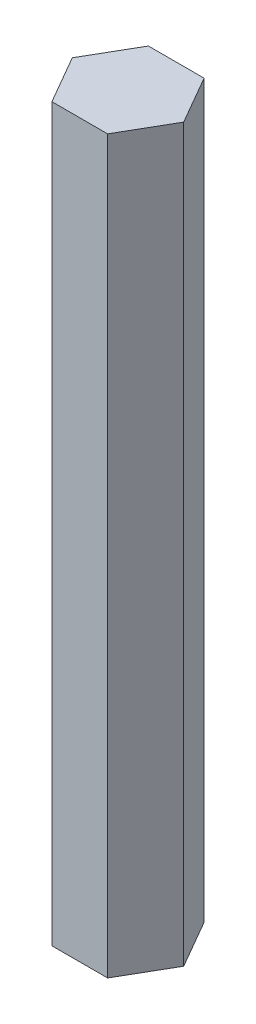
ISO-10303-21;
HEADER;
FILE_DESCRIPTION(('STEP AP214'),'2;1');
FILE_NAME('part.step','',(''),(''),'','','');
FILE_SCHEMA(('AUTOMOTIVE_DESIGN { 1 0 10303 214 1 1 1 1 }'));
ENDSEC;
DATA;
#1=APPLICATION_CONTEXT('core data for automotive mechanical design processes');
#2=APPLICATION_PROTOCOL_DEFINITION('international standard','automotive_design',2000,#1);
#3=PRODUCT_CONTEXT('',#1,'mechanical');
#4=PRODUCT('Part','Part','',(#3));
#5=PRODUCT_RELATED_PRODUCT_CATEGORY('part','',(#4));
#6=PRODUCT_DEFINITION_FORMATION('','',#4);
#7=PRODUCT_DEFINITION_CONTEXT('part definition',#1,'design');
#8=PRODUCT_DEFINITION('design','',#6,#7);
#9=PRODUCT_DEFINITION_SHAPE('','',#8);
#10=(LENGTH_UNIT() NAMED_UNIT(*) SI_UNIT(.MILLI.,.METRE.));
#11=(NAMED_UNIT(*) PLANE_ANGLE_UNIT() SI_UNIT($,.RADIAN.));
#12=(NAMED_UNIT(*) SI_UNIT($,.STERADIAN.) SOLID_ANGLE_UNIT());
#13=UNCERTAINTY_MEASURE_WITH_UNIT(LENGTH_MEASURE(1.E-05),#10,'distance_accuracy_value','');
#14=(GEOMETRIC_REPRESENTATION_CONTEXT(3) GLOBAL_UNCERTAINTY_ASSIGNED_CONTEXT((#13)) GLOBAL_UNIT_ASSIGNED_CONTEXT((#10,
#11,#12)) REPRESENTATION_CONTEXT('',''));
#15=CARTESIAN_POINT('',(0.,0.,0.));
#16=DIRECTION('',(0.,0.,1.));
#17=DIRECTION('',(1.,0.,0.));
#18=AXIS2_PLACEMENT_3D('',#15,#16,#17);
#19=CARTESIAN_POINT('',(3.97705905170191,105.,5.34885921686965));
#20=DIRECTION('',(-0.866025403784439,0.,-0.5));
#21=DIRECTION('',(-0.5,0.,0.866025403784439));
#22=AXIS2_PLACEMENT_3D('',#19,#20,#21);
#23=PLANE('',#22);
#24=DIRECTION('',(0.5,0.,-0.866025403784439));
#25=VECTOR('',#24,1.);
#26=CARTESIAN_POINT('',(3.97705905170191,0.,5.34885921686965));
#27=LINE('',#26,#25);
#28=CARTESIAN_POINT('',(3.97705905170191,0.,5.34885921686965));
#29=VERTEX_POINT('',#28);
#30=CARTESIAN_POINT('',(7.97705905170191,0.,-1.57934401340586));
#31=VERTEX_POINT('',#30);
#32=EDGE_CURVE('E123',#29,#31,#27,.T.);
#33=ORIENTED_EDGE('',*,*,#32,.T.);
#34=DIRECTION('',(0.,-1.,0.));
#35=VECTOR('',#34,1.);
#36=CARTESIAN_POINT('',(7.97705905170191,105.,-1.57934401340586));
#37=LINE('',#36,#35);
#38=CARTESIAN_POINT('',(7.97705905170191,105.,-1.57934401340586));
#39=VERTEX_POINT('',#38);
#40=EDGE_CURVE('E11',#39,#31,#37,.T.);
#41=ORIENTED_EDGE('',*,*,#40,.F.);
#42=DIRECTION('',(0.5,0.,-0.866025403784439));
#43=VECTOR('',#42,1.);
#44=CARTESIAN_POINT('',(3.97705905170191,105.,5.34885921686965));
#45=LINE('',#44,#43);
#46=CARTESIAN_POINT('',(3.97705905170191,105.,5.34885921686965));
#47=VERTEX_POINT('',#46);
#48=EDGE_CURVE('E133',#47,#39,#45,.T.);
#49=ORIENTED_EDGE('',*,*,#48,.F.);
#50=DIRECTION('',(0.,-1.,0.));
#51=VECTOR('',#50,1.);
#52=CARTESIAN_POINT('',(3.97705905170191,105.,5.34885921686965));
#53=LINE('',#52,#51);
#54=EDGE_CURVE('E119',#47,#29,#53,.T.);
#55=ORIENTED_EDGE('',*,*,#54,.T.);
#56=EDGE_LOOP('',(#33,#41,#49,#55));
#57=FACE_BOUND('',#56,.T.);
#58=ADVANCED_FACE('F39',(#57),#23,.F.);
#59=CARTESIAN_POINT('',(7.97705905170191,105.,-1.57934401340586));
#60=DIRECTION('',(-0.866025403784439,0.,0.5));
#61=DIRECTION('',(0.5,0.,0.866025403784439));
#62=AXIS2_PLACEMENT_3D('',#59,#60,#61);
#63=PLANE('',#62);
#64=DIRECTION('',(-0.5,0.,-0.866025403784439));
#65=VECTOR('',#64,1.);
#66=CARTESIAN_POINT('',(7.97705905170191,0.,-1.57934401340586));
#67=LINE('',#66,#65);
#68=CARTESIAN_POINT('',(3.97705905170191,0.,-8.50754724368137));
#69=VERTEX_POINT('',#68);
#70=EDGE_CURVE('E126',#31,#69,#67,.T.);
#71=ORIENTED_EDGE('',*,*,#70,.T.);
#72=DIRECTION('',(0.,-1.,0.));
#73=VECTOR('',#72,1.);
#74=CARTESIAN_POINT('',(3.97705905170191,105.,-8.50754724368137));
#75=LINE('',#74,#73);
#76=CARTESIAN_POINT('',(3.97705905170191,105.,-8.50754724368137));
#77=VERTEX_POINT('',#76);
#78=EDGE_CURVE('E47',#77,#69,#75,.T.);
#79=ORIENTED_EDGE('',*,*,#78,.F.);
#80=DIRECTION('',(-0.5,0.,-0.866025403784439));
#81=VECTOR('',#80,1.);
#82=CARTESIAN_POINT('',(7.97705905170191,105.,-1.57934401340586));
#83=LINE('',#82,#81);
#84=EDGE_CURVE('E92',#39,#77,#83,.T.);
#85=ORIENTED_EDGE('',*,*,#84,.F.);
#86=ORIENTED_EDGE('',*,*,#40,.T.);
#87=EDGE_LOOP('',(#71,#79,#85,#86));
#88=FACE_BOUND('',#87,.T.);
#89=ADVANCED_FACE('F157',(#88),#63,.F.);
#90=CARTESIAN_POINT('',(3.97705905170191,105.,-8.50754724368137));
#91=DIRECTION('',(0.,0.,1.));
#92=DIRECTION('',(1.,0.,0.));
#93=AXIS2_PLACEMENT_3D('',#90,#91,#92);
#94=PLANE('',#93);
#95=DIRECTION('',(-1.,0.,0.));
#96=VECTOR('',#95,1.);
#97=CARTESIAN_POINT('',(3.97705905170191,0.,-8.50754724368137));
#98=LINE('',#97,#96);
#99=CARTESIAN_POINT('',(-4.02294094829809,0.,-8.50754724368137));
#100=VERTEX_POINT('',#99);
#101=EDGE_CURVE('E128',#69,#100,#98,.T.);
#102=ORIENTED_EDGE('',*,*,#101,.T.);
#103=DIRECTION('',(0.,-1.,0.));
#104=VECTOR('',#103,1.);
#105=CARTESIAN_POINT('',(-4.02294094829809,105.,-8.50754724368137));
#106=LINE('',#105,#104);
#107=CARTESIAN_POINT('',(-4.02294094829809,105.,-8.50754724368137));
#108=VERTEX_POINT('',#107);
#109=EDGE_CURVE('E114',#108,#100,#106,.T.);
#110=ORIENTED_EDGE('',*,*,#109,.F.);
#111=DIRECTION('',(-1.,0.,0.));
#112=VECTOR('',#111,1.);
#113=CARTESIAN_POINT('',(3.97705905170191,105.,-8.50754724368137));
#114=LINE('',#113,#112);
#115=EDGE_CURVE('E105',#77,#108,#114,.T.);
#116=ORIENTED_EDGE('',*,*,#115,.F.);
#117=ORIENTED_EDGE('',*,*,#78,.T.);
#118=EDGE_LOOP('',(#102,#110,#116,#117));
#119=FACE_BOUND('',#118,.T.);
#120=ADVANCED_FACE('F139',(#119),#94,.F.);
#121=CARTESIAN_POINT('',(-4.02294094829809,105.,-8.50754724368137));
#122=DIRECTION('',(0.866025403784439,0.,0.5));
#123=DIRECTION('',(0.5,0.,-0.866025403784439));
#124=AXIS2_PLACEMENT_3D('',#121,#122,#123);
#125=PLANE('',#124);
#126=DIRECTION('',(-0.5,0.,0.866025403784439));
#127=VECTOR('',#126,1.);
#128=CARTESIAN_POINT('',(-4.02294094829809,0.,-8.50754724368137));
#129=LINE('',#128,#127);
#130=CARTESIAN_POINT('',(-8.02294094829809,0.,-1.57934401340586));
#131=VERTEX_POINT('',#130);
#132=EDGE_CURVE('E113',#100,#131,#129,.T.);
#133=ORIENTED_EDGE('',*,*,#132,.T.);
#134=DIRECTION('',(0.,-1.,0.));
#135=VECTOR('',#134,1.);
#136=CARTESIAN_POINT('',(-8.02294094829809,105.,-1.57934401340586));
#137=LINE('',#136,#135);
#138=CARTESIAN_POINT('',(-8.02294094829809,105.,-1.57934401340586));
#139=VERTEX_POINT('',#138);
#140=EDGE_CURVE('E110',#139,#131,#137,.T.);
#141=ORIENTED_EDGE('',*,*,#140,.F.);
#142=DIRECTION('',(-0.5,0.,0.866025403784439));
#143=VECTOR('',#142,1.);
#144=CARTESIAN_POINT('',(-4.02294094829809,105.,-8.50754724368137));
#145=LINE('',#144,#143);
#146=EDGE_CURVE('E99',#108,#139,#145,.T.);
#147=ORIENTED_EDGE('',*,*,#146,.F.);
#148=ORIENTED_EDGE('',*,*,#109,.T.);
#149=EDGE_LOOP('',(#133,#141,#147,#148));
#150=FACE_BOUND('',#149,.T.);
#151=ADVANCED_FACE('F111',(#150),#125,.F.);
#152=CARTESIAN_POINT('',(-8.02294094829809,105.,-1.57934401340586));
#153=DIRECTION('',(0.866025403784438,0.,-0.500000000000001));
#154=DIRECTION('',(-0.500000000000001,0.,-0.866025403784438));
#155=AXIS2_PLACEMENT_3D('',#152,#153,#154);
#156=PLANE('',#155);
#157=DIRECTION('',(0.500000000000001,0.,0.866025403784438));
#158=VECTOR('',#157,1.);
#159=CARTESIAN_POINT('',(-8.02294094829809,0.,-1.57934401340586));
#160=LINE('',#159,#158);
#161=CARTESIAN_POINT('',(-4.02294094829809,0.,5.34885921686965));
#162=VERTEX_POINT('',#161);
#163=EDGE_CURVE('E78',#131,#162,#160,.T.);
#164=ORIENTED_EDGE('',*,*,#163,.T.);
#165=DIRECTION('',(0.,-1.,0.));
#166=VECTOR('',#165,1.);
#167=CARTESIAN_POINT('',(-4.02294094829809,105.,5.34885921686965));
#168=LINE('',#167,#166);
#169=CARTESIAN_POINT('',(-4.02294094829809,105.,5.34885921686965));
#170=VERTEX_POINT('',#169);
#171=EDGE_CURVE('E115',#170,#162,#168,.T.);
#172=ORIENTED_EDGE('',*,*,#171,.F.);
#173=DIRECTION('',(0.500000000000001,0.,0.866025403784438));
#174=VECTOR('',#173,1.);
#175=CARTESIAN_POINT('',(-8.02294094829809,105.,-1.57934401340586));
#176=LINE('',#175,#174);
#177=EDGE_CURVE('E103',#139,#170,#176,.T.);
#178=ORIENTED_EDGE('',*,*,#177,.F.);
#179=ORIENTED_EDGE('',*,*,#140,.T.);
#180=EDGE_LOOP('',(#164,#172,#178,#179));
#181=FACE_BOUND('',#180,.T.);
#182=ADVANCED_FACE('F117',(#181),#156,.F.);
#183=CARTESIAN_POINT('',(-4.02294094829809,105.,5.34885921686965));
#184=DIRECTION('',(0.,0.,-1.));
#185=DIRECTION('',(-1.,0.,0.));
#186=AXIS2_PLACEMENT_3D('',#183,#184,#185);
#187=PLANE('',#186);
#188=DIRECTION('',(1.,0.,0.));
#189=VECTOR('',#188,1.);
#190=CARTESIAN_POINT('',(-4.02294094829809,0.,5.34885921686965));
#191=LINE('',#190,#189);
#192=EDGE_CURVE('E84',#162,#29,#191,.T.);
#193=ORIENTED_EDGE('',*,*,#192,.T.);
#194=ORIENTED_EDGE('',*,*,#54,.F.);
#195=DIRECTION('',(1.,0.,0.));
#196=VECTOR('',#195,1.);
#197=CARTESIAN_POINT('',(-4.02294094829809,105.,5.34885921686965));
#198=LINE('',#197,#196);
#199=EDGE_CURVE('E55',#170,#47,#198,.T.);
#200=ORIENTED_EDGE('',*,*,#199,.F.);
#201=ORIENTED_EDGE('',*,*,#171,.T.);
#202=EDGE_LOOP('',(#193,#194,#200,#201));
#203=FACE_BOUND('',#202,.T.);
#204=ADVANCED_FACE('F146',(#203),#187,.F.);
#205=CARTESIAN_POINT('',(0.,105.,0.));
#206=DIRECTION('',(0.,1.,0.));
#207=DIRECTION('',(0.,0.,1.));
#208=AXIS2_PLACEMENT_3D('',#205,#206,#207);
#209=PLANE('',#208);
#210=ORIENTED_EDGE('',*,*,#48,.T.);
#211=ORIENTED_EDGE('',*,*,#84,.T.);
#212=ORIENTED_EDGE('',*,*,#115,.T.);
#213=ORIENTED_EDGE('',*,*,#146,.T.);
#214=ORIENTED_EDGE('',*,*,#177,.T.);
#215=ORIENTED_EDGE('',*,*,#199,.T.);
#216=EDGE_LOOP('',(#210,#211,#212,#213,#214,#215));
#217=FACE_BOUND('',#216,.T.);
#218=ADVANCED_FACE('F101',(#217),#209,.T.);
#219=CARTESIAN_POINT('',(0.,0.,0.));
#220=DIRECTION('',(0.,1.,0.));
#221=DIRECTION('',(0.,0.,1.));
#222=AXIS2_PLACEMENT_3D('',#219,#220,#221);
#223=PLANE('',#222);
#224=ORIENTED_EDGE('',*,*,#32,.F.);
#225=ORIENTED_EDGE('',*,*,#192,.F.);
#226=ORIENTED_EDGE('',*,*,#163,.F.);
#227=ORIENTED_EDGE('',*,*,#132,.F.);
#228=ORIENTED_EDGE('',*,*,#101,.F.);
#229=ORIENTED_EDGE('',*,*,#70,.F.);
#230=EDGE_LOOP('',(#224,#225,#226,#227,#228,#229));
#231=FACE_BOUND('',#230,.T.);
#232=ADVANCED_FACE('F142',(#231),#223,.F.);
#233=CLOSED_SHELL('',(#58,#89,#120,#151,#182,#204,#218,#232));
#234=MANIFOLD_SOLID_BREP('B2',#233);
#235=ADVANCED_BREP_SHAPE_REPRESENTATION('',(#18,#234),#14);
#236=SHAPE_DEFINITION_REPRESENTATION(#9,#235);
ENDSEC;
END-ISO-10303-21;
